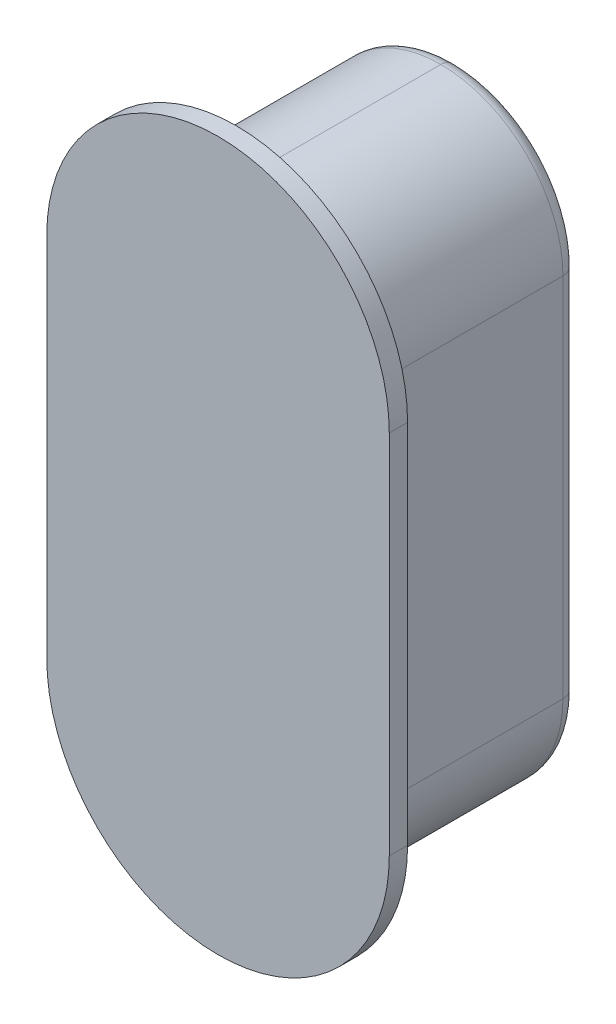
ISO-10303-21;
HEADER;
FILE_DESCRIPTION(('STEP AP214'),'2;1');
FILE_NAME('part.step','',(''),(''),'','','');
FILE_SCHEMA(('AUTOMOTIVE_DESIGN { 1 0 10303 214 1 1 1 1 }'));
ENDSEC;
DATA;
#1=APPLICATION_CONTEXT('core data for automotive mechanical design processes');
#2=APPLICATION_PROTOCOL_DEFINITION('international standard','automotive_design',2000,#1);
#3=PRODUCT_CONTEXT('',#1,'mechanical');
#4=PRODUCT('Part','Part','',(#3));
#5=PRODUCT_RELATED_PRODUCT_CATEGORY('part','',(#4));
#6=PRODUCT_DEFINITION_FORMATION('','',#4);
#7=PRODUCT_DEFINITION_CONTEXT('part definition',#1,'design');
#8=PRODUCT_DEFINITION('design','',#6,#7);
#9=PRODUCT_DEFINITION_SHAPE('','',#8);
#10=(LENGTH_UNIT() NAMED_UNIT(*) SI_UNIT(.MILLI.,.METRE.));
#11=(NAMED_UNIT(*) PLANE_ANGLE_UNIT() SI_UNIT($,.RADIAN.));
#12=(NAMED_UNIT(*) SI_UNIT($,.STERADIAN.) SOLID_ANGLE_UNIT());
#13=UNCERTAINTY_MEASURE_WITH_UNIT(LENGTH_MEASURE(1.E-05),#10,'distance_accuracy_value','');
#14=(GEOMETRIC_REPRESENTATION_CONTEXT(3) GLOBAL_UNCERTAINTY_ASSIGNED_CONTEXT((#13)) GLOBAL_UNIT_ASSIGNED_CONTEXT((#10,
#11,#12)) REPRESENTATION_CONTEXT('',''));
#15=CARTESIAN_POINT('',(0.,0.,0.));
#16=DIRECTION('',(0.,0.,1.));
#17=DIRECTION('',(1.,0.,0.));
#18=AXIS2_PLACEMENT_3D('',#15,#16,#17);
#19=CARTESIAN_POINT('',(6.75000010430813,5.50000008195639,1.75));
#20=DIRECTION('',(0.,1.,0.));
#21=DIRECTION('',(0.707106781186547,0.,-0.707106781186548));
#22=AXIS2_PLACEMENT_3D('',#19,#20,#21);
#23=CYLINDRICAL_SURFACE('',#22,0.25);
#24=CARTESIAN_POINT('',(6.75000010430813,5.00000004470348,1.75));
#25=DIRECTION('',(0.,1.,0.));
#26=DIRECTION('',(1.,0.,0.));
#27=AXIS2_PLACEMENT_3D('',#24,#25,#26);
#28=CIRCLE('',#27,0.25);
#29=CARTESIAN_POINT('',(7.00000010430813,5.00000004470348,1.75));
#30=VERTEX_POINT('',#29);
#31=CARTESIAN_POINT('',(6.75000010430813,5.00000004470348,1.5));
#32=VERTEX_POINT('',#31);
#33=EDGE_CURVE('E11',#30,#32,#28,.T.);
#34=ORIENTED_EDGE('',*,*,#33,.T.);
#35=DIRECTION('',(0.,1.,0.));
#36=VECTOR('',#35,1.);
#37=CARTESIAN_POINT('',(6.75000010430813,5.50000008195639,1.5));
#38=LINE('',#37,#36);
#39=CARTESIAN_POINT('',(6.75000010430813,11.0000001937151,1.5));
#40=VERTEX_POINT('',#39);
#41=EDGE_CURVE('E27',#32,#40,#38,.T.);
#42=ORIENTED_EDGE('',*,*,#41,.T.);
#43=CARTESIAN_POINT('',(6.75000010430813,11.0000001937151,1.75));
#44=DIRECTION('',(0.,-1.,0.));
#45=DIRECTION('',(0.,0.,-1.));
#46=AXIS2_PLACEMENT_3D('',#43,#44,#45);
#47=CIRCLE('',#46,0.25);
#48=CARTESIAN_POINT('',(7.00000010430813,11.0000001937151,1.75));
#49=VERTEX_POINT('',#48);
#50=EDGE_CURVE('E203',#40,#49,#47,.T.);
#51=ORIENTED_EDGE('',*,*,#50,.T.);
#52=DIRECTION('',(0.,-1.,0.));
#53=VECTOR('',#52,1.);
#54=CARTESIAN_POINT('',(7.00000010430813,5.50000008195639,1.75));
#55=LINE('',#54,#53);
#56=EDGE_CURVE('E233',#49,#30,#55,.T.);
#57=ORIENTED_EDGE('',*,*,#56,.T.);
#58=EDGE_LOOP('',(#34,#42,#51,#57));
#59=FACE_BOUND('',#58,.T.);
#60=ADVANCED_FACE('F16',(#59),#23,.T.);
#61=CARTESIAN_POINT('',(5.00000010430813,11.0000001937151,1.75));
#62=DIRECTION('',(0.,0.,1.));
#63=DIRECTION('',(1.,0.,0.));
#64=AXIS2_PLACEMENT_3D('',#61,#62,#63);
#65=TOROIDAL_SURFACE('',#64,1.75,0.25);
#66=CARTESIAN_POINT('',(5.00000010430813,12.7500001937151,1.75));
#67=DIRECTION('',(1.,0.,0.));
#68=DIRECTION('',(0.,0.,-1.));
#69=AXIS2_PLACEMENT_3D('',#66,#67,#68);
#70=CIRCLE('',#69,0.25);
#71=CARTESIAN_POINT('',(5.00000010430813,12.7500001937151,1.5));
#72=VERTEX_POINT('',#71);
#73=CARTESIAN_POINT('',(5.00000010430813,13.0000001937151,1.75));
#74=VERTEX_POINT('',#73);
#75=EDGE_CURVE('E229',#72,#74,#70,.T.);
#76=ORIENTED_EDGE('',*,*,#75,.T.);
#77=CARTESIAN_POINT('',(5.00000010430813,11.0000001937151,1.75));
#78=DIRECTION('',(0.,0.,-1.));
#79=DIRECTION('',(0.707106781186548,0.707106781186548,0.));
#80=AXIS2_PLACEMENT_3D('',#77,#78,#79);
#81=CIRCLE('',#80,2.);
#82=EDGE_CURVE('E234',#74,#49,#81,.T.);
#83=ORIENTED_EDGE('',*,*,#82,.T.);
#84=ORIENTED_EDGE('',*,*,#50,.F.);
#85=CARTESIAN_POINT('',(5.00000010430813,11.0000001937151,1.5));
#86=DIRECTION('',(0.,0.,1.));
#87=DIRECTION('',(0.707106781186548,0.707106781186548,0.));
#88=AXIS2_PLACEMENT_3D('',#85,#86,#87);
#89=CIRCLE('',#88,1.75);
#90=EDGE_CURVE('E284',#40,#72,#89,.T.);
#91=ORIENTED_EDGE('',*,*,#90,.T.);
#92=EDGE_LOOP('',(#76,#83,#84,#91));
#93=FACE_BOUND('',#92,.T.);
#94=ADVANCED_FACE('F348',(#93),#65,.T.);
#95=CARTESIAN_POINT('',(5.00000004470348,11.0000001937151,1.75));
#96=DIRECTION('',(0.,0.,1.));
#97=DIRECTION('',(1.,0.,0.));
#98=AXIS2_PLACEMENT_3D('',#95,#96,#97);
#99=TOROIDAL_SURFACE('',#98,1.75,0.25);
#100=CARTESIAN_POINT('',(3.25000004470348,11.0000001937151,1.75));
#101=DIRECTION('',(0.,1.,0.));
#102=DIRECTION('',(0.,0.,-1.));
#103=AXIS2_PLACEMENT_3D('',#100,#101,#102);
#104=CIRCLE('',#103,0.25);
#105=CARTESIAN_POINT('',(3.25000004470348,11.0000001937151,1.5));
#106=VERTEX_POINT('',#105);
#107=CARTESIAN_POINT('',(3.00000004470348,11.0000001937151,1.75));
#108=VERTEX_POINT('',#107);
#109=EDGE_CURVE('E159',#106,#108,#104,.T.);
#110=ORIENTED_EDGE('',*,*,#109,.T.);
#111=CARTESIAN_POINT('',(5.00000004470348,11.0000001937151,1.75));
#112=DIRECTION('',(0.,0.,-1.));
#113=DIRECTION('',(-0.707106770649835,0.70710679172326,0.));
#114=AXIS2_PLACEMENT_3D('',#111,#112,#113);
#115=CIRCLE('',#114,2.);
#116=EDGE_CURVE('E235',#108,#74,#115,.T.);
#117=ORIENTED_EDGE('',*,*,#116,.T.);
#118=ORIENTED_EDGE('',*,*,#75,.F.);
#119=CARTESIAN_POINT('',(5.00000004470348,11.0000001937151,1.5));
#120=DIRECTION('',(0.,0.,1.));
#121=DIRECTION('',(-0.707106770649835,0.70710679172326,0.));
#122=AXIS2_PLACEMENT_3D('',#119,#120,#121);
#123=CIRCLE('',#122,1.75);
#124=EDGE_CURVE('E175',#72,#106,#123,.T.);
#125=ORIENTED_EDGE('',*,*,#124,.T.);
#126=EDGE_LOOP('',(#110,#117,#118,#125));
#127=FACE_BOUND('',#126,.T.);
#128=ADVANCED_FACE('F351',(#127),#99,.T.);
#129=CARTESIAN_POINT('',(3.25000004470348,10.5000001564622,1.75));
#130=DIRECTION('',(0.,-1.,0.));
#131=DIRECTION('',(-0.707106781186548,0.,-0.707106781186547));
#132=AXIS2_PLACEMENT_3D('',#129,#130,#131);
#133=CYLINDRICAL_SURFACE('',#132,0.25);
#134=CARTESIAN_POINT('',(3.25000004470348,5.00000004470348,1.75));
#135=DIRECTION('',(0.,1.,0.));
#136=DIRECTION('',(0.,0.,-1.));
#137=AXIS2_PLACEMENT_3D('',#134,#135,#136);
#138=CIRCLE('',#137,0.25);
#139=CARTESIAN_POINT('',(3.25000004470348,5.00000004470348,1.5));
#140=VERTEX_POINT('',#139);
#141=CARTESIAN_POINT('',(3.00000004470348,5.00000004470348,1.75));
#142=VERTEX_POINT('',#141);
#143=EDGE_CURVE('E157',#140,#142,#138,.T.);
#144=ORIENTED_EDGE('',*,*,#143,.T.);
#145=DIRECTION('',(0.,1.,0.));
#146=VECTOR('',#145,1.);
#147=CARTESIAN_POINT('',(3.00000004470348,10.5000001564622,1.75));
#148=LINE('',#147,#146);
#149=EDGE_CURVE('E163',#142,#108,#148,.T.);
#150=ORIENTED_EDGE('',*,*,#149,.T.);
#151=ORIENTED_EDGE('',*,*,#109,.F.);
#152=DIRECTION('',(0.,-1.,0.));
#153=VECTOR('',#152,1.);
#154=CARTESIAN_POINT('',(3.25000004470348,10.5000001564622,1.5));
#155=LINE('',#154,#153);
#156=EDGE_CURVE('E154',#106,#140,#155,.T.);
#157=ORIENTED_EDGE('',*,*,#156,.T.);
#158=EDGE_LOOP('',(#144,#150,#151,#157));
#159=FACE_BOUND('',#158,.T.);
#160=ADVANCED_FACE('F156',(#159),#133,.T.);
#161=CARTESIAN_POINT('',(5.00000004470348,5.00000004470348,1.75));
#162=DIRECTION('',(0.,0.,1.));
#163=DIRECTION('',(1.,0.,0.));
#164=AXIS2_PLACEMENT_3D('',#161,#162,#163);
#165=TOROIDAL_SURFACE('',#164,1.75,0.25);
#166=CARTESIAN_POINT('',(5.00000004470348,3.25000004470348,1.75));
#167=DIRECTION('',(-1.,0.,0.));
#168=DIRECTION('',(0.,0.,-1.));
#169=AXIS2_PLACEMENT_3D('',#166,#167,#168);
#170=CIRCLE('',#169,0.25);
#171=CARTESIAN_POINT('',(5.00000004470348,3.25000004470348,1.5));
#172=VERTEX_POINT('',#171);
#173=CARTESIAN_POINT('',(5.00000004470348,3.00000004470348,1.75));
#174=VERTEX_POINT('',#173);
#175=EDGE_CURVE('E164',#172,#174,#170,.T.);
#176=ORIENTED_EDGE('',*,*,#175,.T.);
#177=CARTESIAN_POINT('',(5.00000004470348,5.00000004470348,1.75));
#178=DIRECTION('',(0.,0.,-1.));
#179=DIRECTION('',(-0.707106781186548,-0.707106781186548,0.));
#180=AXIS2_PLACEMENT_3D('',#177,#178,#179);
#181=CIRCLE('',#180,2.);
#182=EDGE_CURVE('E172',#174,#142,#181,.T.);
#183=ORIENTED_EDGE('',*,*,#182,.T.);
#184=ORIENTED_EDGE('',*,*,#143,.F.);
#185=CARTESIAN_POINT('',(5.00000004470348,5.00000004470348,1.5));
#186=DIRECTION('',(0.,0.,1.));
#187=DIRECTION('',(-0.707106781186548,-0.707106781186548,0.));
#188=AXIS2_PLACEMENT_3D('',#185,#186,#187);
#189=CIRCLE('',#188,1.75);
#190=EDGE_CURVE('E169',#140,#172,#189,.T.);
#191=ORIENTED_EDGE('',*,*,#190,.T.);
#192=EDGE_LOOP('',(#176,#183,#184,#191));
#193=FACE_BOUND('',#192,.T.);
#194=ADVANCED_FACE('F168',(#193),#165,.T.);
#195=CARTESIAN_POINT('',(5.00000010430813,5.00000004470348,1.75));
#196=DIRECTION('',(0.,0.,1.));
#197=DIRECTION('',(1.,0.,0.));
#198=AXIS2_PLACEMENT_3D('',#195,#196,#197);
#199=TOROIDAL_SURFACE('',#198,1.75,0.25);
#200=ORIENTED_EDGE('',*,*,#33,.F.);
#201=CARTESIAN_POINT('',(5.00000010430813,5.00000004470348,1.75));
#202=DIRECTION('',(0.,0.,-1.));
#203=DIRECTION('',(0.707106770649835,-0.70710679172326,0.));
#204=AXIS2_PLACEMENT_3D('',#201,#202,#203);
#205=CIRCLE('',#204,2.);
#206=EDGE_CURVE('E20',#30,#174,#205,.T.);
#207=ORIENTED_EDGE('',*,*,#206,.T.);
#208=ORIENTED_EDGE('',*,*,#175,.F.);
#209=CARTESIAN_POINT('',(5.00000010430813,5.00000004470348,1.5));
#210=DIRECTION('',(0.,0.,1.));
#211=DIRECTION('',(0.707106770649835,-0.70710679172326,0.));
#212=AXIS2_PLACEMENT_3D('',#209,#210,#211);
#213=CIRCLE('',#212,1.75);
#214=EDGE_CURVE('E179',#172,#32,#213,.T.);
#215=ORIENTED_EDGE('',*,*,#214,.T.);
#216=EDGE_LOOP('',(#200,#207,#208,#215));
#217=FACE_BOUND('',#216,.T.);
#218=ADVANCED_FACE('F371',(#217),#199,.T.);
#219=CARTESIAN_POINT('',(5.00000004470348,5.00000004470348,1.5));
#220=DIRECTION('',(0.,0.,1.));
#221=DIRECTION('',(-0.707106781186548,-0.707106781186548,0.));
#222=AXIS2_PLACEMENT_3D('',#219,#220,#221);
#223=CYLINDRICAL_SURFACE('',#222,2.);
#224=ORIENTED_EDGE('',*,*,#182,.F.);
#225=DIRECTION('',(0.,0.,1.));
#226=VECTOR('',#225,1.);
#227=CARTESIAN_POINT('',(5.00000004470348,3.00000004470348,1.5));
#228=LINE('',#227,#226);
#229=CARTESIAN_POINT('',(5.00000004470348,3.00000004470348,4.85));
#230=VERTEX_POINT('',#229);
#231=EDGE_CURVE('E194',#174,#230,#228,.T.);
#232=ORIENTED_EDGE('',*,*,#231,.T.);
#233=CARTESIAN_POINT('',(5.00000004470348,5.00000004470348,4.85));
#234=DIRECTION('',(0.,0.,1.));
#235=DIRECTION('',(-0.707106781186548,-0.707106781186548,0.));
#236=AXIS2_PLACEMENT_3D('',#233,#234,#235);
#237=CIRCLE('',#236,2.);
#238=CARTESIAN_POINT('',(3.00000004470348,5.00000004470348,4.85));
#239=VERTEX_POINT('',#238);
#240=EDGE_CURVE('E122',#239,#230,#237,.T.);
#241=ORIENTED_EDGE('',*,*,#240,.F.);
#242=DIRECTION('',(0.,0.,-1.));
#243=VECTOR('',#242,1.);
#244=CARTESIAN_POINT('',(3.00000004470348,5.00000004470348,1.5));
#245=LINE('',#244,#243);
#246=EDGE_CURVE('E295',#239,#142,#245,.T.);
#247=ORIENTED_EDGE('',*,*,#246,.T.);
#248=EDGE_LOOP('',(#224,#232,#241,#247));
#249=FACE_BOUND('',#248,.T.);
#250=ADVANCED_FACE('F374',(#249),#223,.T.);
#251=CARTESIAN_POINT('',(5.00000010430813,5.00000004470348,1.5));
#252=DIRECTION('',(0.,0.,1.));
#253=DIRECTION('',(0.707106781186548,-0.707106781186548,0.));
#254=AXIS2_PLACEMENT_3D('',#251,#252,#253);
#255=CYLINDRICAL_SURFACE('',#254,2.);
#256=ORIENTED_EDGE('',*,*,#206,.F.);
#257=DIRECTION('',(0.,0.,1.));
#258=VECTOR('',#257,1.);
#259=CARTESIAN_POINT('',(7.00000010430813,5.00000004470348,1.5));
#260=LINE('',#259,#258);
#261=CARTESIAN_POINT('',(7.00000010430813,5.00000004470348,4.85));
#262=VERTEX_POINT('',#261);
#263=EDGE_CURVE('E312',#30,#262,#260,.T.);
#264=ORIENTED_EDGE('',*,*,#263,.T.);
#265=CARTESIAN_POINT('',(5.00000010430813,5.00000004470348,4.85));
#266=DIRECTION('',(0.,0.,1.));
#267=DIRECTION('',(0.707106770649835,-0.70710679172326,0.));
#268=AXIS2_PLACEMENT_3D('',#265,#266,#267);
#269=CIRCLE('',#268,2.);
#270=EDGE_CURVE('E111',#230,#262,#269,.T.);
#271=ORIENTED_EDGE('',*,*,#270,.F.);
#272=ORIENTED_EDGE('',*,*,#231,.F.);
#273=EDGE_LOOP('',(#256,#264,#271,#272));
#274=FACE_BOUND('',#273,.T.);
#275=ADVANCED_FACE('F372',(#274),#255,.T.);
#276=CARTESIAN_POINT('',(7.00000010430813,3.00000004470348,1.5));
#277=DIRECTION('',(1.,0.,0.));
#278=DIRECTION('',(0.,1.,0.));
#279=AXIS2_PLACEMENT_3D('',#276,#277,#278);
#280=PLANE('',#279);
#281=ORIENTED_EDGE('',*,*,#56,.F.);
#282=DIRECTION('',(0.,0.,-1.));
#283=VECTOR('',#282,1.);
#284=CARTESIAN_POINT('',(7.00000010430813,11.0000001937151,1.5));
#285=LINE('',#284,#283);
#286=CARTESIAN_POINT('',(7.00000010430813,11.0000001937151,4.85));
#287=VERTEX_POINT('',#286);
#288=EDGE_CURVE('E238',#287,#49,#285,.T.);
#289=ORIENTED_EDGE('',*,*,#288,.F.);
#290=DIRECTION('',(0.,1.,0.));
#291=VECTOR('',#290,1.);
#292=CARTESIAN_POINT('',(7.00000010430813,5.50000008195639,4.85));
#293=LINE('',#292,#291);
#294=EDGE_CURVE('E247',#262,#287,#293,.T.);
#295=ORIENTED_EDGE('',*,*,#294,.F.);
#296=ORIENTED_EDGE('',*,*,#263,.F.);
#297=EDGE_LOOP('',(#281,#289,#295,#296));
#298=FACE_BOUND('',#297,.T.);
#299=ADVANCED_FACE('F365',(#298),#280,.T.);
#300=CARTESIAN_POINT('',(5.00000007450581,8.00000011920929,1.5));
#301=DIRECTION('',(0.,0.,1.));
#302=DIRECTION('',(1.,0.,0.));
#303=AXIS2_PLACEMENT_3D('',#300,#301,#302);
#304=PLANE('',#303);
#305=ORIENTED_EDGE('',*,*,#41,.F.);
#306=ORIENTED_EDGE('',*,*,#214,.F.);
#307=ORIENTED_EDGE('',*,*,#190,.F.);
#308=ORIENTED_EDGE('',*,*,#156,.F.);
#309=ORIENTED_EDGE('',*,*,#124,.F.);
#310=ORIENTED_EDGE('',*,*,#90,.F.);
#311=EDGE_LOOP('',(#305,#306,#307,#308,#309,#310));
#312=FACE_BOUND('',#311,.T.);
#313=ADVANCED_FACE('F177',(#312),#304,.F.);
#314=CARTESIAN_POINT('',(7.25000010430813,5.50000008195639,4.85));
#315=DIRECTION('',(0.,1.,0.));
#316=DIRECTION('',(-0.707106781186549,0.,0.707106781186546));
#317=AXIS2_PLACEMENT_3D('',#314,#315,#316);
#318=CYLINDRICAL_SURFACE('',#317,0.25);
#319=CARTESIAN_POINT('',(7.25000010430813,5.00000004470348,4.85));
#320=DIRECTION('',(0.,-1.,0.));
#321=DIRECTION('',(0.,0.,1.));
#322=AXIS2_PLACEMENT_3D('',#319,#320,#321);
#323=CIRCLE('',#322,0.25);
#324=CARTESIAN_POINT('',(7.25000010430813,5.00000004470348,5.1));
#325=VERTEX_POINT('',#324);
#326=EDGE_CURVE('E306',#325,#262,#323,.T.);
#327=ORIENTED_EDGE('',*,*,#326,.T.);
#328=ORIENTED_EDGE('',*,*,#294,.T.);
#329=CARTESIAN_POINT('',(7.25000010430813,11.0000001937151,4.85));
#330=DIRECTION('',(0.,1.,0.));
#331=DIRECTION('',(-1.,0.,0.));
#332=AXIS2_PLACEMENT_3D('',#329,#330,#331);
#333=CIRCLE('',#332,0.25);
#334=CARTESIAN_POINT('',(7.25000010430813,11.0000001937151,5.1));
#335=VERTEX_POINT('',#334);
#336=EDGE_CURVE('E219',#287,#335,#333,.T.);
#337=ORIENTED_EDGE('',*,*,#336,.T.);
#338=DIRECTION('',(0.,-1.,0.));
#339=VECTOR('',#338,1.);
#340=CARTESIAN_POINT('',(7.25000010430813,5.50000008195639,5.1));
#341=LINE('',#340,#339);
#342=EDGE_CURVE('E216',#335,#325,#341,.T.);
#343=ORIENTED_EDGE('',*,*,#342,.T.);
#344=EDGE_LOOP('',(#327,#328,#337,#343));
#345=FACE_BOUND('',#344,.T.);
#346=ADVANCED_FACE('F394',(#345),#318,.F.);
#347=CARTESIAN_POINT('',(5.00000010430813,11.0000001937151,4.85));
#348=DIRECTION('',(0.,0.,-1.));
#349=DIRECTION('',(-1.,0.,0.));
#350=AXIS2_PLACEMENT_3D('',#347,#348,#349);
#351=TOROIDAL_SURFACE('',#350,2.25,0.25);
#352=CARTESIAN_POINT('',(5.00000010430813,13.2500001937151,4.85));
#353=DIRECTION('',(-1.,0.,0.));
#354=DIRECTION('',(0.,-1.,0.));
#355=AXIS2_PLACEMENT_3D('',#352,#353,#354);
#356=CIRCLE('',#355,0.25);
#357=CARTESIAN_POINT('',(5.00000010430813,13.0000001937151,4.85));
#358=VERTEX_POINT('',#357);
#359=CARTESIAN_POINT('',(5.00000010430813,13.2500001937151,5.1));
#360=VERTEX_POINT('',#359);
#361=EDGE_CURVE('E214',#358,#360,#356,.T.);
#362=ORIENTED_EDGE('',*,*,#361,.T.);
#363=CARTESIAN_POINT('',(5.00000010430813,11.0000001937151,5.1));
#364=DIRECTION('',(0.,0.,-1.));
#365=DIRECTION('',(0.707106781186548,0.707106781186548,0.));
#366=AXIS2_PLACEMENT_3D('',#363,#364,#365);
#367=CIRCLE('',#366,2.25);
#368=EDGE_CURVE('E210',#360,#335,#367,.T.);
#369=ORIENTED_EDGE('',*,*,#368,.T.);
#370=ORIENTED_EDGE('',*,*,#336,.F.);
#371=CARTESIAN_POINT('',(5.00000010430813,11.0000001937151,4.85));
#372=DIRECTION('',(0.,0.,1.));
#373=DIRECTION('',(0.707106781186548,0.707106781186548,0.));
#374=AXIS2_PLACEMENT_3D('',#371,#372,#373);
#375=CIRCLE('',#374,2.);
#376=EDGE_CURVE('E215',#287,#358,#375,.T.);
#377=ORIENTED_EDGE('',*,*,#376,.T.);
#378=EDGE_LOOP('',(#362,#369,#370,#377));
#379=FACE_BOUND('',#378,.T.);
#380=ADVANCED_FACE('F18',(#379),#351,.F.);
#381=CARTESIAN_POINT('',(5.00000004470348,11.0000001937151,4.85));
#382=DIRECTION('',(0.,0.,-1.));
#383=DIRECTION('',(-1.,0.,0.));
#384=AXIS2_PLACEMENT_3D('',#381,#382,#383);
#385=TOROIDAL_SURFACE('',#384,2.25,0.25);
#386=CARTESIAN_POINT('',(2.75000004470348,11.0000001937151,4.85));
#387=DIRECTION('',(0.,-1.,0.));
#388=DIRECTION('',(1.,0.,0.));
#389=AXIS2_PLACEMENT_3D('',#386,#387,#388);
#390=CIRCLE('',#389,0.25);
#391=CARTESIAN_POINT('',(3.00000004470348,11.0000001937151,4.85));
#392=VERTEX_POINT('',#391);
#393=CARTESIAN_POINT('',(2.75000004470348,11.0000001937151,5.1));
#394=VERTEX_POINT('',#393);
#395=EDGE_CURVE('E208',#392,#394,#390,.T.);
#396=ORIENTED_EDGE('',*,*,#395,.T.);
#397=CARTESIAN_POINT('',(5.00000004470348,11.0000001937151,5.1));
#398=DIRECTION('',(0.,0.,-1.));
#399=DIRECTION('',(-0.707106770649835,0.70710679172326,0.));
#400=AXIS2_PLACEMENT_3D('',#397,#398,#399);
#401=CIRCLE('',#400,2.25);
#402=EDGE_CURVE('E204',#394,#360,#401,.T.);
#403=ORIENTED_EDGE('',*,*,#402,.T.);
#404=ORIENTED_EDGE('',*,*,#361,.F.);
#405=CARTESIAN_POINT('',(5.00000004470348,11.0000001937151,4.85));
#406=DIRECTION('',(0.,0.,1.));
#407=DIRECTION('',(-0.707106770649835,0.70710679172326,0.));
#408=AXIS2_PLACEMENT_3D('',#405,#406,#407);
#409=CIRCLE('',#408,2.);
#410=EDGE_CURVE('E209',#358,#392,#409,.T.);
#411=ORIENTED_EDGE('',*,*,#410,.T.);
#412=EDGE_LOOP('',(#396,#403,#404,#411));
#413=FACE_BOUND('',#412,.T.);
#414=ADVANCED_FACE('F564',(#413),#385,.F.);
#415=CARTESIAN_POINT('',(2.75000004470348,10.5000001564622,4.85));
#416=DIRECTION('',(0.,-1.,0.));
#417=DIRECTION('',(0.707106781186548,0.,0.707106781186548));
#418=AXIS2_PLACEMENT_3D('',#415,#416,#417);
#419=CYLINDRICAL_SURFACE('',#418,0.25);
#420=CARTESIAN_POINT('',(2.75000004470348,5.00000004470348,4.85));
#421=DIRECTION('',(0.,-1.,0.));
#422=DIRECTION('',(1.,0.,0.));
#423=AXIS2_PLACEMENT_3D('',#420,#421,#422);
#424=CIRCLE('',#423,0.25);
#425=CARTESIAN_POINT('',(2.75000004470348,5.00000004470348,5.1));
#426=VERTEX_POINT('',#425);
#427=EDGE_CURVE('E251',#239,#426,#424,.T.);
#428=ORIENTED_EDGE('',*,*,#427,.T.);
#429=DIRECTION('',(0.,1.,0.));
#430=VECTOR('',#429,1.);
#431=CARTESIAN_POINT('',(2.75000004470348,10.5000001564622,5.1));
#432=LINE('',#431,#430);
#433=EDGE_CURVE('E248',#426,#394,#432,.T.);
#434=ORIENTED_EDGE('',*,*,#433,.T.);
#435=ORIENTED_EDGE('',*,*,#395,.F.);
#436=DIRECTION('',(0.,-1.,0.));
#437=VECTOR('',#436,1.);
#438=CARTESIAN_POINT('',(3.00000004470348,10.5000001564622,4.85));
#439=LINE('',#438,#437);
#440=EDGE_CURVE('E252',#392,#239,#439,.T.);
#441=ORIENTED_EDGE('',*,*,#440,.T.);
#442=EDGE_LOOP('',(#428,#434,#435,#441));
#443=FACE_BOUND('',#442,.T.);
#444=ADVANCED_FACE('F559',(#443),#419,.F.);
#445=CARTESIAN_POINT('',(5.00000004470348,5.00000004470348,4.85));
#446=DIRECTION('',(0.,0.,-1.));
#447=DIRECTION('',(-1.,0.,0.));
#448=AXIS2_PLACEMENT_3D('',#445,#446,#447);
#449=TOROIDAL_SURFACE('',#448,2.25,0.25);
#450=CARTESIAN_POINT('',(5.00000004470348,2.75000004470348,4.85));
#451=DIRECTION('',(1.,0.,0.));
#452=DIRECTION('',(0.,1.,0.));
#453=AXIS2_PLACEMENT_3D('',#450,#451,#452);
#454=CIRCLE('',#453,0.25);
#455=CARTESIAN_POINT('',(5.00000004470348,2.75000004470348,5.1));
#456=VERTEX_POINT('',#455);
#457=EDGE_CURVE('E289',#230,#456,#454,.T.);
#458=ORIENTED_EDGE('',*,*,#457,.T.);
#459=CARTESIAN_POINT('',(5.00000004470348,5.00000004470348,5.1));
#460=DIRECTION('',(0.,0.,-1.));
#461=DIRECTION('',(-0.707106781186548,-0.707106781186548,0.));
#462=AXIS2_PLACEMENT_3D('',#459,#460,#461);
#463=CIRCLE('',#462,2.25);
#464=EDGE_CURVE('E285',#456,#426,#463,.T.);
#465=ORIENTED_EDGE('',*,*,#464,.T.);
#466=ORIENTED_EDGE('',*,*,#427,.F.);
#467=ORIENTED_EDGE('',*,*,#240,.T.);
#468=EDGE_LOOP('',(#458,#465,#466,#467));
#469=FACE_BOUND('',#468,.T.);
#470=ADVANCED_FACE('F399',(#469),#449,.F.);
#471=CARTESIAN_POINT('',(5.00000010430813,5.00000004470348,4.85));
#472=DIRECTION('',(0.,0.,-1.));
#473=DIRECTION('',(-1.,0.,0.));
#474=AXIS2_PLACEMENT_3D('',#471,#472,#473);
#475=TOROIDAL_SURFACE('',#474,2.25,0.25);
#476=ORIENTED_EDGE('',*,*,#457,.F.);
#477=ORIENTED_EDGE('',*,*,#270,.T.);
#478=ORIENTED_EDGE('',*,*,#326,.F.);
#479=CARTESIAN_POINT('',(5.00000010430813,5.00000004470348,5.1));
#480=DIRECTION('',(0.,0.,-1.));
#481=DIRECTION('',(0.707106770649835,-0.70710679172326,0.));
#482=AXIS2_PLACEMENT_3D('',#479,#480,#481);
#483=CIRCLE('',#482,2.25);
#484=EDGE_CURVE('E220',#325,#456,#483,.T.);
#485=ORIENTED_EDGE('',*,*,#484,.T.);
#486=EDGE_LOOP('',(#476,#477,#478,#485));
#487=FACE_BOUND('',#486,.T.);
#488=ADVANCED_FACE('F377',(#487),#475,.F.);
#489=CARTESIAN_POINT('',(5.00000004470348,11.0000001937151,1.5));
#490=DIRECTION('',(0.,0.,1.));
#491=DIRECTION('',(-0.707106781186547,0.707106781186548,0.));
#492=AXIS2_PLACEMENT_3D('',#489,#490,#491);
#493=CYLINDRICAL_SURFACE('',#492,2.);
#494=ORIENTED_EDGE('',*,*,#116,.F.);
#495=DIRECTION('',(0.,0.,1.));
#496=VECTOR('',#495,1.);
#497=CARTESIAN_POINT('',(3.00000004470348,11.0000001937151,1.5));
#498=LINE('',#497,#496);
#499=EDGE_CURVE('E223',#108,#392,#498,.T.);
#500=ORIENTED_EDGE('',*,*,#499,.T.);
#501=ORIENTED_EDGE('',*,*,#410,.F.);
#502=DIRECTION('',(0.,0.,1.));
#503=VECTOR('',#502,1.);
#504=CARTESIAN_POINT('',(5.00000010430813,13.0000001937151,1.5));
#505=LINE('',#504,#503);
#506=EDGE_CURVE('E242',#74,#358,#505,.T.);
#507=ORIENTED_EDGE('',*,*,#506,.F.);
#508=EDGE_LOOP('',(#494,#500,#501,#507));
#509=FACE_BOUND('',#508,.T.);
#510=ADVANCED_FACE('F628',(#509),#493,.T.);
#511=CARTESIAN_POINT('',(5.00000010430813,11.0000001937151,1.5));
#512=DIRECTION('',(0.,0.,1.));
#513=DIRECTION('',(0.707106781186548,0.707106781186547,0.));
#514=AXIS2_PLACEMENT_3D('',#511,#512,#513);
#515=CYLINDRICAL_SURFACE('',#514,2.);
#516=ORIENTED_EDGE('',*,*,#82,.F.);
#517=ORIENTED_EDGE('',*,*,#506,.T.);
#518=ORIENTED_EDGE('',*,*,#376,.F.);
#519=ORIENTED_EDGE('',*,*,#288,.T.);
#520=EDGE_LOOP('',(#516,#517,#518,#519));
#521=FACE_BOUND('',#520,.T.);
#522=ADVANCED_FACE('F358',(#521),#515,.T.);
#523=CARTESIAN_POINT('',(5.00000007450581,8.00000011920929,5.1));
#524=DIRECTION('',(0.,0.,1.));
#525=DIRECTION('',(1.,0.,0.));
#526=AXIS2_PLACEMENT_3D('',#523,#524,#525);
#527=PLANE('',#526);
#528=CARTESIAN_POINT('',(5.00000010430813,11.0000001937151,5.1));
#529=DIRECTION('',(0.,0.,1.));
#530=DIRECTION('',(1.,0.,0.));
#531=AXIS2_PLACEMENT_3D('',#528,#529,#530);
#532=CIRCLE('',#531,2.80511397369619);
#533=CARTESIAN_POINT('',(7.80511407800432,11.0000001937151,5.1));
#534=VERTEX_POINT('',#533);
#535=CARTESIAN_POINT('',(2.19488607100729,11.0000001937151,5.1));
#536=VERTEX_POINT('',#535);
#537=EDGE_CURVE('E228',#534,#536,#532,.T.);
#538=ORIENTED_EDGE('',*,*,#537,.F.);
#539=DIRECTION('',(0.,1.,0.));
#540=VECTOR('',#539,1.);
#541=CARTESIAN_POINT('',(7.80511407800432,5.00000004470348,5.1));
#542=LINE('',#541,#540);
#543=CARTESIAN_POINT('',(7.80511407800432,5.00000004470348,5.1));
#544=VERTEX_POINT('',#543);
#545=EDGE_CURVE('E243',#544,#534,#542,.T.);
#546=ORIENTED_EDGE('',*,*,#545,.F.);
#547=CARTESIAN_POINT('',(5.00000004470348,5.00000004470348,5.1));
#548=DIRECTION('',(0.,0.,1.));
#549=DIRECTION('',(-1.,0.,0.));
#550=AXIS2_PLACEMENT_3D('',#547,#548,#549);
#551=CIRCLE('',#550,2.80511397369619);
#552=CARTESIAN_POINT('',(2.19488607100729,5.00000004470348,5.1));
#553=VERTEX_POINT('',#552);
#554=EDGE_CURVE('E261',#553,#544,#551,.T.);
#555=ORIENTED_EDGE('',*,*,#554,.F.);
#556=DIRECTION('',(0.,-1.,0.));
#557=VECTOR('',#556,1.);
#558=CARTESIAN_POINT('',(2.19488607100729,11.0000001937151,5.1));
#559=LINE('',#558,#557);
#560=EDGE_CURVE('E190',#536,#553,#559,.T.);
#561=ORIENTED_EDGE('',*,*,#560,.F.);
#562=EDGE_LOOP('',(#538,#546,#555,#561));
#563=FACE_BOUND('',#562,.T.);
#564=ORIENTED_EDGE('',*,*,#342,.F.);
#565=ORIENTED_EDGE('',*,*,#368,.F.);
#566=ORIENTED_EDGE('',*,*,#402,.F.);
#567=ORIENTED_EDGE('',*,*,#433,.F.);
#568=ORIENTED_EDGE('',*,*,#464,.F.);
#569=ORIENTED_EDGE('',*,*,#484,.F.);
#570=EDGE_LOOP('',(#564,#565,#566,#567,#568,#569));
#571=FACE_BOUND('',#570,.T.);
#572=ADVANCED_FACE('F397',(#563,#571),#527,.F.);
#573=CARTESIAN_POINT('',(7.80511407800432,5.00000004470348,5.1));
#574=DIRECTION('',(1.,0.,0.));
#575=DIRECTION('',(0.,1.,0.));
#576=AXIS2_PLACEMENT_3D('',#573,#574,#575);
#577=PLANE('',#576);
#578=ORIENTED_EDGE('',*,*,#545,.T.);
#579=DIRECTION('',(0.,0.,1.));
#580=VECTOR('',#579,1.);
#581=CARTESIAN_POINT('',(7.80511407800432,11.0000001937151,5.1));
#582=LINE('',#581,#580);
#583=CARTESIAN_POINT('',(7.80511407800432,11.0000001937151,5.4));
#584=VERTEX_POINT('',#583);
#585=EDGE_CURVE('E265',#534,#584,#582,.T.);
#586=ORIENTED_EDGE('',*,*,#585,.T.);
#587=DIRECTION('',(0.,1.,0.));
#588=VECTOR('',#587,1.);
#589=CARTESIAN_POINT('',(7.80511407800432,5.00000004470348,5.4));
#590=LINE('',#589,#588);
#591=CARTESIAN_POINT('',(7.80511407800432,5.00000004470348,5.4));
#592=VERTEX_POINT('',#591);
#593=EDGE_CURVE('E280',#592,#584,#590,.T.);
#594=ORIENTED_EDGE('',*,*,#593,.F.);
#595=DIRECTION('',(0.,0.,1.));
#596=VECTOR('',#595,1.);
#597=CARTESIAN_POINT('',(7.80511407800432,5.00000004470348,5.1));
#598=LINE('',#597,#596);
#599=EDGE_CURVE('E266',#544,#592,#598,.T.);
#600=ORIENTED_EDGE('',*,*,#599,.F.);
#601=EDGE_LOOP('',(#578,#586,#594,#600));
#602=FACE_BOUND('',#601,.T.);
#603=ADVANCED_FACE('F431',(#602),#577,.T.);
#604=CARTESIAN_POINT('',(5.00000004470348,5.00000004470348,5.1));
#605=DIRECTION('',(0.,0.,1.));
#606=DIRECTION('',(-1.,0.,0.));
#607=AXIS2_PLACEMENT_3D('',#604,#605,#606);
#608=CYLINDRICAL_SURFACE('',#607,2.80511397369619);
#609=ORIENTED_EDGE('',*,*,#554,.T.);
#610=ORIENTED_EDGE('',*,*,#599,.T.);
#611=CARTESIAN_POINT('',(5.00000004470348,5.00000004470348,5.4));
#612=DIRECTION('',(0.,0.,1.));
#613=DIRECTION('',(-1.,0.,0.));
#614=AXIS2_PLACEMENT_3D('',#611,#612,#613);
#615=CIRCLE('',#614,2.80511397369619);
#616=CARTESIAN_POINT('',(2.19488607100729,5.00000004470348,5.4));
#617=VERTEX_POINT('',#616);
#618=EDGE_CURVE('E273',#617,#592,#615,.T.);
#619=ORIENTED_EDGE('',*,*,#618,.F.);
#620=DIRECTION('',(0.,0.,1.));
#621=VECTOR('',#620,1.);
#622=CARTESIAN_POINT('',(2.19488607100729,5.00000004470348,5.1));
#623=LINE('',#622,#621);
#624=EDGE_CURVE('E259',#553,#617,#623,.T.);
#625=ORIENTED_EDGE('',*,*,#624,.F.);
#626=EDGE_LOOP('',(#609,#610,#619,#625));
#627=FACE_BOUND('',#626,.T.);
#628=ADVANCED_FACE('F536',(#627),#608,.T.);
#629=CARTESIAN_POINT('',(2.19488607100729,11.0000001937151,5.1));
#630=DIRECTION('',(-1.,0.,0.));
#631=DIRECTION('',(0.,0.,1.));
#632=AXIS2_PLACEMENT_3D('',#629,#630,#631);
#633=PLANE('',#632);
#634=ORIENTED_EDGE('',*,*,#560,.T.);
#635=ORIENTED_EDGE('',*,*,#624,.T.);
#636=DIRECTION('',(0.,-1.,0.));
#637=VECTOR('',#636,1.);
#638=CARTESIAN_POINT('',(2.19488607100729,11.0000001937151,5.4));
#639=LINE('',#638,#637);
#640=CARTESIAN_POINT('',(2.19488607100729,11.0000001937151,5.4));
#641=VERTEX_POINT('',#640);
#642=EDGE_CURVE('E200',#641,#617,#639,.T.);
#643=ORIENTED_EDGE('',*,*,#642,.F.);
#644=DIRECTION('',(0.,0.,1.));
#645=VECTOR('',#644,1.);
#646=CARTESIAN_POINT('',(2.19488607100729,11.0000001937151,5.1));
#647=LINE('',#646,#645);
#648=EDGE_CURVE('E199',#536,#641,#647,.T.);
#649=ORIENTED_EDGE('',*,*,#648,.F.);
#650=EDGE_LOOP('',(#634,#635,#643,#649));
#651=FACE_BOUND('',#650,.T.);
#652=ADVANCED_FACE('F418',(#651),#633,.T.);
#653=CARTESIAN_POINT('',(5.00000010430813,11.0000001937151,5.1));
#654=DIRECTION('',(0.,0.,1.));
#655=DIRECTION('',(1.,0.,0.));
#656=AXIS2_PLACEMENT_3D('',#653,#654,#655);
#657=CYLINDRICAL_SURFACE('',#656,2.80511397369619);
#658=ORIENTED_EDGE('',*,*,#537,.T.);
#659=ORIENTED_EDGE('',*,*,#648,.T.);
#660=CARTESIAN_POINT('',(5.00000010430813,11.0000001937151,5.4));
#661=DIRECTION('',(0.,0.,1.));
#662=DIRECTION('',(1.,0.,0.));
#663=AXIS2_PLACEMENT_3D('',#660,#661,#662);
#664=CIRCLE('',#663,2.80511397369619);
#665=EDGE_CURVE('E195',#584,#641,#664,.T.);
#666=ORIENTED_EDGE('',*,*,#665,.F.);
#667=ORIENTED_EDGE('',*,*,#585,.F.);
#668=EDGE_LOOP('',(#658,#659,#666,#667));
#669=FACE_BOUND('',#668,.T.);
#670=ADVANCED_FACE('F423',(#669),#657,.T.);
#671=CARTESIAN_POINT('',(5.00000007450581,8.00000011920929,5.4));
#672=DIRECTION('',(0.,0.,1.));
#673=DIRECTION('',(1.,0.,0.));
#674=AXIS2_PLACEMENT_3D('',#671,#672,#673);
#675=PLANE('',#674);
#676=ORIENTED_EDGE('',*,*,#665,.T.);
#677=ORIENTED_EDGE('',*,*,#642,.T.);
#678=ORIENTED_EDGE('',*,*,#618,.T.);
#679=ORIENTED_EDGE('',*,*,#593,.T.);
#680=EDGE_LOOP('',(#676,#677,#678,#679));
#681=FACE_BOUND('',#680,.T.);
#682=ADVANCED_FACE('F427',(#681),#675,.T.);
#683=CARTESIAN_POINT('',(3.00000004470348,13.0000001937151,1.5));
#684=DIRECTION('',(-1.,0.,0.));
#685=DIRECTION('',(0.,0.,1.));
#686=AXIS2_PLACEMENT_3D('',#683,#684,#685);
#687=PLANE('',#686);
#688=ORIENTED_EDGE('',*,*,#149,.F.);
#689=ORIENTED_EDGE('',*,*,#246,.F.);
#690=ORIENTED_EDGE('',*,*,#440,.F.);
#691=ORIENTED_EDGE('',*,*,#499,.F.);
#692=EDGE_LOOP('',(#688,#689,#690,#691));
#693=FACE_BOUND('',#692,.T.);
#694=ADVANCED_FACE('F546',(#693),#687,.T.);
#695=CLOSED_SHELL('',(#60,#94,#128,#160,#194,#218,#250,#275,#299,#313,#346,#380,#414,#444,#470,
#488,#510,#522,#572,#603,#628,#652,#670,#682,#694));
#696=MANIFOLD_SOLID_BREP('B1',#695);
#697=ADVANCED_BREP_SHAPE_REPRESENTATION('',(#18,#696),#14);
#698=SHAPE_DEFINITION_REPRESENTATION(#9,#697);
ENDSEC;
END-ISO-10303-21;
